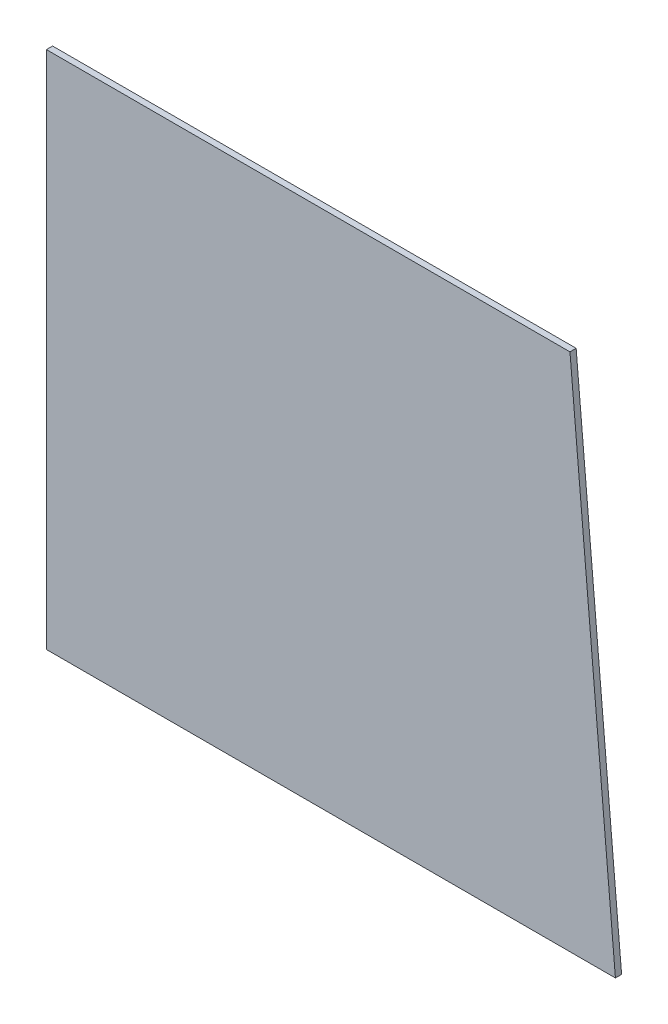
ISO-10303-21;
HEADER;
FILE_DESCRIPTION(('STEP AP214'),'2;1');
FILE_NAME('part.step','',(''),(''),'','','');
FILE_SCHEMA(('AUTOMOTIVE_DESIGN { 1 0 10303 214 1 1 1 1 }'));
ENDSEC;
DATA;
#1=APPLICATION_CONTEXT('core data for automotive mechanical design processes');
#2=APPLICATION_PROTOCOL_DEFINITION('international standard','automotive_design',2000,#1);
#3=PRODUCT_CONTEXT('',#1,'mechanical');
#4=PRODUCT('Part','Part','',(#3));
#5=PRODUCT_RELATED_PRODUCT_CATEGORY('part','',(#4));
#6=PRODUCT_DEFINITION_FORMATION('','',#4);
#7=PRODUCT_DEFINITION_CONTEXT('part definition',#1,'design');
#8=PRODUCT_DEFINITION('design','',#6,#7);
#9=PRODUCT_DEFINITION_SHAPE('','',#8);
#10=(LENGTH_UNIT() NAMED_UNIT(*) SI_UNIT(.MILLI.,.METRE.));
#11=(NAMED_UNIT(*) PLANE_ANGLE_UNIT() SI_UNIT($,.RADIAN.));
#12=(NAMED_UNIT(*) SI_UNIT($,.STERADIAN.) SOLID_ANGLE_UNIT());
#13=UNCERTAINTY_MEASURE_WITH_UNIT(LENGTH_MEASURE(1.E-05),#10,'distance_accuracy_value','');
#14=(GEOMETRIC_REPRESENTATION_CONTEXT(3) GLOBAL_UNCERTAINTY_ASSIGNED_CONTEXT((#13)) GLOBAL_UNIT_ASSIGNED_CONTEXT((#10,
#11,#12)) REPRESENTATION_CONTEXT('',''));
#15=CARTESIAN_POINT('',(0.,0.,0.));
#16=DIRECTION('',(0.,0.,1.));
#17=DIRECTION('',(1.,0.,0.));
#18=AXIS2_PLACEMENT_3D('',#15,#16,#17);
#19=CARTESIAN_POINT('',(0.,0.,1.5875));
#20=DIRECTION('',(1.,0.,0.));
#21=DIRECTION('',(0.,0.,-1.));
#22=AXIS2_PLACEMENT_3D('',#19,#20,#21);
#23=PLANE('',#22);
#24=DIRECTION('',(0.,-1.,0.));
#25=VECTOR('',#24,1.);
#26=CARTESIAN_POINT('',(0.,0.,0.));
#27=LINE('',#26,#25);
#28=CARTESIAN_POINT('',(0.,133.35,0.));
#29=VERTEX_POINT('',#28);
#30=CARTESIAN_POINT('',(0.,0.,0.));
#31=VERTEX_POINT('',#30);
#32=EDGE_CURVE('E98',#29,#31,#27,.T.);
#33=ORIENTED_EDGE('',*,*,#32,.T.);
#34=DIRECTION('',(0.,0.,-1.));
#35=VECTOR('',#34,1.);
#36=CARTESIAN_POINT('',(0.,0.,1.5875));
#37=LINE('',#36,#35);
#38=CARTESIAN_POINT('',(0.,0.,1.5875));
#39=VERTEX_POINT('',#38);
#40=EDGE_CURVE('E11',#39,#31,#37,.T.);
#41=ORIENTED_EDGE('',*,*,#40,.F.);
#42=DIRECTION('',(0.,-1.,0.));
#43=VECTOR('',#42,1.);
#44=CARTESIAN_POINT('',(0.,0.,1.5875));
#45=LINE('',#44,#43);
#46=CARTESIAN_POINT('',(0.,133.35,1.5875));
#47=VERTEX_POINT('',#46);
#48=EDGE_CURVE('E86',#47,#39,#45,.T.);
#49=ORIENTED_EDGE('',*,*,#48,.F.);
#50=DIRECTION('',(0.,0.,-1.));
#51=VECTOR('',#50,1.);
#52=CARTESIAN_POINT('',(0.,133.35,1.5875));
#53=LINE('',#52,#51);
#54=EDGE_CURVE('E94',#47,#29,#53,.T.);
#55=ORIENTED_EDGE('',*,*,#54,.T.);
#56=EDGE_LOOP('',(#33,#41,#49,#55));
#57=FACE_BOUND('',#56,.T.);
#58=ADVANCED_FACE('F35',(#57),#23,.F.);
#59=CARTESIAN_POINT('',(0.,0.,1.5875));
#60=DIRECTION('',(0.,1.,0.));
#61=DIRECTION('',(0.,0.,1.));
#62=AXIS2_PLACEMENT_3D('',#59,#60,#61);
#63=PLANE('',#62);
#64=DIRECTION('',(1.,0.,0.));
#65=VECTOR('',#64,1.);
#66=CARTESIAN_POINT('',(0.,0.,0.));
#67=LINE('',#66,#65);
#68=CARTESIAN_POINT('',(146.05,0.,0.));
#69=VERTEX_POINT('',#68);
#70=EDGE_CURVE('E90',#31,#69,#67,.T.);
#71=ORIENTED_EDGE('',*,*,#70,.T.);
#72=DIRECTION('',(0.,0.,-1.));
#73=VECTOR('',#72,1.);
#74=CARTESIAN_POINT('',(146.05,0.,1.5875));
#75=LINE('',#74,#73);
#76=CARTESIAN_POINT('',(146.05,0.,1.5875));
#77=VERTEX_POINT('',#76);
#78=EDGE_CURVE('E43',#77,#69,#75,.T.);
#79=ORIENTED_EDGE('',*,*,#78,.F.);
#80=DIRECTION('',(1.,0.,0.));
#81=VECTOR('',#80,1.);
#82=CARTESIAN_POINT('',(0.,0.,1.5875));
#83=LINE('',#82,#81);
#84=EDGE_CURVE('E81',#39,#77,#83,.T.);
#85=ORIENTED_EDGE('',*,*,#84,.F.);
#86=ORIENTED_EDGE('',*,*,#40,.T.);
#87=EDGE_LOOP('',(#71,#79,#85,#86));
#88=FACE_BOUND('',#87,.T.);
#89=ADVANCED_FACE('F89',(#88),#63,.F.);
#90=CARTESIAN_POINT('',(146.05,0.,1.5875));
#91=DIRECTION('',(-0.996194698091746,-0.0871557427476581,0.));
#92=DIRECTION('',(0.0871557427476581,-0.996194698091746,0.));
#93=AXIS2_PLACEMENT_3D('',#90,#91,#92);
#94=PLANE('',#93);
#95=DIRECTION('',(-0.0871557427476581,0.996194698091746,0.));
#96=VECTOR('',#95,1.);
#97=CARTESIAN_POINT('',(146.05,0.,0.));
#98=LINE('',#97,#96);
#99=CARTESIAN_POINT('',(134.383386718818,133.35,0.));
#100=VERTEX_POINT('',#99);
#101=EDGE_CURVE('E68',#69,#100,#98,.T.);
#102=ORIENTED_EDGE('',*,*,#101,.T.);
#103=DIRECTION('',(0.,0.,-1.));
#104=VECTOR('',#103,1.);
#105=CARTESIAN_POINT('',(134.383386718818,133.35,1.5875));
#106=LINE('',#105,#104);
#107=CARTESIAN_POINT('',(134.383386718818,133.35,1.5875));
#108=VERTEX_POINT('',#107);
#109=EDGE_CURVE('E91',#108,#100,#106,.T.);
#110=ORIENTED_EDGE('',*,*,#109,.F.);
#111=DIRECTION('',(-0.0871557427476581,0.996194698091746,0.));
#112=VECTOR('',#111,1.);
#113=CARTESIAN_POINT('',(146.05,0.,1.5875));
#114=LINE('',#113,#112);
#115=EDGE_CURVE('E84',#77,#108,#114,.T.);
#116=ORIENTED_EDGE('',*,*,#115,.F.);
#117=ORIENTED_EDGE('',*,*,#78,.T.);
#118=EDGE_LOOP('',(#102,#110,#116,#117));
#119=FACE_BOUND('',#118,.T.);
#120=ADVANCED_FACE('F92',(#119),#94,.F.);
#121=CARTESIAN_POINT('',(0.,133.35,1.5875));
#122=DIRECTION('',(0.,-1.,0.));
#123=DIRECTION('',(0.,0.,-1.));
#124=AXIS2_PLACEMENT_3D('',#121,#122,#123);
#125=PLANE('',#124);
#126=DIRECTION('',(-1.,0.,0.));
#127=VECTOR('',#126,1.);
#128=CARTESIAN_POINT('',(0.,133.35,0.));
#129=LINE('',#128,#127);
#130=EDGE_CURVE('E74',#100,#29,#129,.T.);
#131=ORIENTED_EDGE('',*,*,#130,.T.);
#132=ORIENTED_EDGE('',*,*,#54,.F.);
#133=DIRECTION('',(-1.,0.,0.));
#134=VECTOR('',#133,1.);
#135=CARTESIAN_POINT('',(0.,133.35,1.5875));
#136=LINE('',#135,#134);
#137=EDGE_CURVE('E51',#108,#47,#136,.T.);
#138=ORIENTED_EDGE('',*,*,#137,.F.);
#139=ORIENTED_EDGE('',*,*,#109,.T.);
#140=EDGE_LOOP('',(#131,#132,#138,#139));
#141=FACE_BOUND('',#140,.T.);
#142=ADVANCED_FACE('F105',(#141),#125,.F.);
#143=CARTESIAN_POINT('',(0.,0.,1.5875));
#144=DIRECTION('',(0.,0.,-1.));
#145=DIRECTION('',(-1.,0.,0.));
#146=AXIS2_PLACEMENT_3D('',#143,#144,#145);
#147=PLANE('',#146);
#148=ORIENTED_EDGE('',*,*,#48,.T.);
#149=ORIENTED_EDGE('',*,*,#84,.T.);
#150=ORIENTED_EDGE('',*,*,#115,.T.);
#151=ORIENTED_EDGE('',*,*,#137,.T.);
#152=EDGE_LOOP('',(#148,#149,#150,#151));
#153=FACE_BOUND('',#152,.T.);
#154=ADVANCED_FACE('F82',(#153),#147,.F.);
#155=CARTESIAN_POINT('',(0.,0.,0.));
#156=DIRECTION('',(0.,0.,-1.));
#157=DIRECTION('',(-1.,0.,0.));
#158=AXIS2_PLACEMENT_3D('',#155,#156,#157);
#159=PLANE('',#158);
#160=ORIENTED_EDGE('',*,*,#32,.F.);
#161=ORIENTED_EDGE('',*,*,#130,.F.);
#162=ORIENTED_EDGE('',*,*,#101,.F.);
#163=ORIENTED_EDGE('',*,*,#70,.F.);
#164=EDGE_LOOP('',(#160,#161,#162,#163));
#165=FACE_BOUND('',#164,.T.);
#166=ADVANCED_FACE('F108',(#165),#159,.T.);
#167=CLOSED_SHELL('',(#58,#89,#120,#142,#154,#166));
#168=MANIFOLD_SOLID_BREP('B2',#167);
#169=ADVANCED_BREP_SHAPE_REPRESENTATION('',(#18,#168),#14);
#170=SHAPE_DEFINITION_REPRESENTATION(#9,#169);
ENDSEC;
END-ISO-10303-21;
